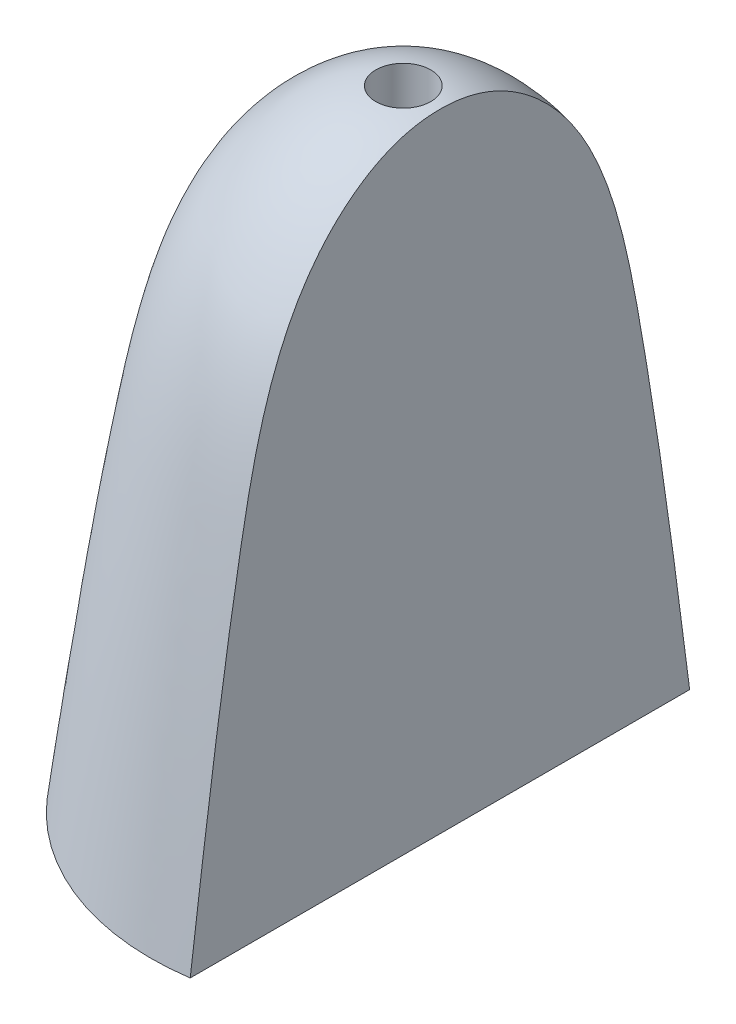
ISO-10303-21;
HEADER;
FILE_DESCRIPTION(('STEP AP214'),'2;1');
FILE_NAME('part.step','',(''),(''),'','','');
FILE_SCHEMA(('AUTOMOTIVE_DESIGN { 1 0 10303 214 1 1 1 1 }'));
ENDSEC;
DATA;
#1=APPLICATION_CONTEXT('core data for automotive mechanical design processes');
#2=APPLICATION_PROTOCOL_DEFINITION('international standard','automotive_design',2000,#1);
#3=PRODUCT_CONTEXT('',#1,'mechanical');
#4=PRODUCT('Part','Part','',(#3));
#5=PRODUCT_RELATED_PRODUCT_CATEGORY('part','',(#4));
#6=PRODUCT_DEFINITION_FORMATION('','',#4);
#7=PRODUCT_DEFINITION_CONTEXT('part definition',#1,'design');
#8=PRODUCT_DEFINITION('design','',#6,#7);
#9=PRODUCT_DEFINITION_SHAPE('','',#8);
#10=(LENGTH_UNIT() NAMED_UNIT(*) SI_UNIT(.MILLI.,.METRE.));
#11=(NAMED_UNIT(*) PLANE_ANGLE_UNIT() SI_UNIT($,.RADIAN.));
#12=(NAMED_UNIT(*) SI_UNIT($,.STERADIAN.) SOLID_ANGLE_UNIT());
#13=UNCERTAINTY_MEASURE_WITH_UNIT(LENGTH_MEASURE(1.E-05),#10,'distance_accuracy_value','');
#14=(GEOMETRIC_REPRESENTATION_CONTEXT(3) GLOBAL_UNCERTAINTY_ASSIGNED_CONTEXT((#13)) GLOBAL_UNIT_ASSIGNED_CONTEXT((#10,
#11,#12)) REPRESENTATION_CONTEXT('',''));
#15=CARTESIAN_POINT('',(0.,0.,0.));
#16=DIRECTION('',(0.,0.,1.));
#17=DIRECTION('',(1.,0.,0.));
#18=AXIS2_PLACEMENT_3D('',#15,#16,#17);
#19=CARTESIAN_POINT('',(6.88,0.,0.));
#20=CARTESIAN_POINT('',(6.47690165518344,3.17769283241905,0.));
#21=CARTESIAN_POINT('',(5.80886829189499,8.35775424687315,0.));
#22=CARTESIAN_POINT('',(4.37828927648046,15.4645962006851,0.));
#23=CARTESIAN_POINT('',(1.11106057892877,17.2802335156458,0.));
#24=CARTESIAN_POINT('',(0.,17.2,0.));
#25=B_SPLINE_CURVE_WITH_KNOTS('',3,(#19,#20,#21,#22,#23,#24),.UNSPECIFIED.,.F.,.F.,(4,1,1,4),
(0.,0.473754928065121,0.83849243058151,1.),.UNSPECIFIED.);
#26=CARTESIAN_POINT('',(0.,18.0579057061154,0.));
#27=DIRECTION('',(0.,1.,0.));
#28=AXIS1_PLACEMENT('',#26,#27);
#29=SURFACE_OF_REVOLUTION('',#25,#28);
#30=CARTESIAN_POINT('',(0.,17.1593653620972,0.));
#31=DIRECTION('',(0.,1.,0.));
#32=DIRECTION('',(0.,0.,1.));
#33=AXIS2_PLACEMENT_3D('',#30,#31,#32);
#34=CIRCLE('',#33,0.750000000000002);
#35=CARTESIAN_POINT('',(0.,17.1593653620972,0.750000000000002));
#36=VERTEX_POINT('',#35);
#37=EDGE_CURVE('E185',#36,#36,#34,.F.);
#38=ORIENTED_EDGE('',*,*,#37,.T.);
#39=EDGE_LOOP('',(#38));
#40=FACE_BOUND('',#39,.T.);
#41=CARTESIAN_POINT('',(1.,0.,-6.8069376374402));
#42=CARTESIAN_POINT('',(1.,0.325630724910655,-6.76518373550329));
#43=CARTESIAN_POINT('',(1.,0.651253473278133,-6.7233642438564));
#44=CARTESIAN_POINT('',(1.,1.30351985313046,-6.63913779643726));
#45=CARTESIAN_POINT('',(1.,1.63016329230628,-6.5967293532776));
#46=CARTESIAN_POINT('',(1.,2.28420434834058,-6.51102917643607));
#47=CARTESIAN_POINT('',(1.,2.61160170115588,-6.46773542117755));
#48=CARTESIAN_POINT('',(1.,3.26688126965538,-6.37995188866716));
#49=CARTESIAN_POINT('',(1.,3.59476319775362,-6.33545995928494));
#50=CARTESIAN_POINT('',(1.,4.25074316902371,-6.2449711752896));
#51=CARTESIAN_POINT('',(1.,4.5788409596492,-6.19897248531578));
#52=CARTESIAN_POINT('',(1.,5.2349861630474,-6.10517878849851));
#53=CARTESIAN_POINT('',(1.,5.56303342070914,-6.05738269418856));
#54=CARTESIAN_POINT('',(1.,6.23911470271178,-5.95671223634639));
#55=CARTESIAN_POINT('',(1.,6.58712922706167,-5.90370665303548));
#56=CARTESIAN_POINT('',(1.,7.28260491822555,-5.79510441209983));
#57=CARTESIAN_POINT('',(1.,7.63006625625954,-5.73950885409394));
#58=CARTESIAN_POINT('',(1.,8.15076053294847,-5.65400676545338));
#59=CARTESIAN_POINT('',(1.,8.3241691708583,-5.6251672410478));
#60=CARTESIAN_POINT('',(1.,8.67086436631517,-5.56675582456074));
#61=CARTESIAN_POINT('',(1.,8.84415092308082,-5.53718392783465));
#62=CARTESIAN_POINT('',(1.,9.10387448944329,-5.49228070846698));
#63=CARTESIAN_POINT('',(1.,9.1903603823503,-5.47723169501576));
#64=CARTESIAN_POINT('',(1.,9.36329907182524,-5.44694479601924));
#65=CARTESIAN_POINT('',(1.,9.4497518683796,-5.43170691039652));
#66=CARTESIAN_POINT('',(1.,9.70903044976889,-5.38554687526954));
#67=CARTESIAN_POINT('',(1.,9.8817775984942,-5.3541781471419));
#68=CARTESIAN_POINT('',(1.,10.2266383602988,-5.28943838767826));
#69=CARTESIAN_POINT('',(1.,10.3987525302671,-5.25607034908394));
#70=CARTESIAN_POINT('',(1.,10.7424036282819,-5.18643548096292));
#71=CARTESIAN_POINT('',(1.,10.9139405407412,-5.1501685738042));
#72=CARTESIAN_POINT('',(1.,11.2561398475446,-5.07386867623961));
#73=CARTESIAN_POINT('',(1.,11.4268024321778,-5.03383654551293));
#74=CARTESIAN_POINT('',(1.,11.7669547684463,-4.94908748588783));
#75=CARTESIAN_POINT('',(1.,11.9364446381214,-4.9043710360243));
#76=CARTESIAN_POINT('',(1.,12.2186448331177,-4.82483876658157));
#77=CARTESIAN_POINT('',(1.,12.3317910862566,-4.79156964529218));
#78=CARTESIAN_POINT('',(1.,12.5572074840467,-4.72216050903644));
#79=CARTESIAN_POINT('',(1.,12.6694775996119,-4.6860203992));
#80=CARTESIAN_POINT('',(1.,12.892949141258,-4.61054984847056));
#81=CARTESIAN_POINT('',(1.,13.0041505237877,-4.57121927817673));
#82=CARTESIAN_POINT('',(1.,13.2248506998165,-4.48918974666945));
#83=CARTESIAN_POINT('',(1.,13.3343541936387,-4.44650347075803));
#84=CARTESIAN_POINT('',(1.,13.5518114820349,-4.35730537690135));
#85=CARTESIAN_POINT('',(1.,13.6597651214702,-4.31079317907875));
#86=CARTESIAN_POINT('',(1.,13.873798179127,-4.21362034556357));
#87=CARTESIAN_POINT('',(1.,13.9798774630547,-4.1629594140761));
#88=CARTESIAN_POINT('',(1.,14.2442558566948,-4.02972818894831));
#89=CARTESIAN_POINT('',(1.,14.4011025571077,-3.94423618672721));
#90=CARTESIAN_POINT('',(1.,14.7081254864984,-3.76196383121557));
#91=CARTESIAN_POINT('',(0.999999999999999,14.858301920545,-3.66518382529215));
#92=CARTESIAN_POINT('',(1.,15.1502452259197,-3.45961208819087));
#93=CARTESIAN_POINT('',(1.00000000000001,15.2920120325885,-3.35082026467591));
#94=CARTESIAN_POINT('',(0.999999999999993,15.5651897070575,-3.12092349296525));
#95=CARTESIAN_POINT('',(0.999999999999972,15.6966036483847,-2.99982222379811));
#96=CARTESIAN_POINT('',(0.999999999999979,15.9090810342319,-2.78426965377604));
#97=CARTESIAN_POINT('',(0.999999999999995,15.9933027534781,-2.69291406131553));
#98=CARTESIAN_POINT('',(1.00000000000001,16.1551705918999,-2.50453400701932));
#99=CARTESIAN_POINT('',(1.,16.232817122197,-2.40750990025634));
#100=CARTESIAN_POINT('',(0.999999999999999,16.3803975765514,-2.20798317453374));
#101=CARTESIAN_POINT('',(1.,16.4503436940124,-2.10548960991976));
#102=CARTESIAN_POINT('',(1.,16.5814804128002,-1.89503426851931));
#103=CARTESIAN_POINT('',(1.,16.6426726862794,-1.78707354141495));
#104=CARTESIAN_POINT('',(1.,16.7458499010108,-1.58399007412601));
#105=CARTESIAN_POINT('',(1.,16.7893401615443,-1.48963244751748));
#106=CARTESIAN_POINT('',(1.,16.8684663428114,-1.2976860907947));
#107=CARTESIAN_POINT('',(1.,16.904104080725,-1.20009811425233));
#108=CARTESIAN_POINT('',(1.,16.9668758424214,-1.00217582353099));
#109=CARTESIAN_POINT('',(1.,16.9940067437563,-0.901840515598335));
#110=CARTESIAN_POINT('',(1.,17.0393553411734,-0.699169088723154));
#111=CARTESIAN_POINT('',(1.,17.0575725533354,-0.596832861465198));
#112=CARTESIAN_POINT('',(1.,17.085128351924,-0.390940077489392));
#113=CARTESIAN_POINT('',(1.,17.0944633649685,-0.287383046579562));
#114=CARTESIAN_POINT('',(1.,17.1045564194792,-0.0798435310542998));
#115=CARTESIAN_POINT('',(1.,17.1053131164444,0.0241390176988233));
#116=CARTESIAN_POINT('',(1.,17.0982910700647,0.231757145355891));
#117=CARTESIAN_POINT('',(1.,17.0905175908188,0.335392898704497));
#118=CARTESIAN_POINT('',(1.,17.0661386231189,0.541606437185932));
#119=CARTESIAN_POINT('',(1.,17.0495352248645,0.644184466845228));
#120=CARTESIAN_POINT('',(1.,17.0073986232804,0.847449796567969));
#121=CARTESIAN_POINT('',(1.,16.9818689106768,0.948137819542963));
#122=CARTESIAN_POINT('',(1.,16.9222004958238,1.14692926615582));
#123=CARTESIAN_POINT('',(1.,16.8880610864179,1.24503247675905));
#124=CARTESIAN_POINT('',(1.,16.811766122454,1.43817911998058));
#125=CARTESIAN_POINT('',(1.,16.7696020313018,1.53321916697461));
#126=CARTESIAN_POINT('',(1.,16.6780378957834,1.71978317009742));
#127=CARTESIAN_POINT('',(1.,16.6286340991481,1.81130527167035));
#128=CARTESIAN_POINT('',(1.,16.5048092158707,2.02220966681855));
#129=CARTESIAN_POINT('',(1.,16.4277118126913,2.14002724153519));
#130=CARTESIAN_POINT('',(1.,16.2635424264656,2.36844283285249));
#131=CARTESIAN_POINT('',(1.,16.1764668513271,2.47903822686907));
#132=CARTESIAN_POINT('',(1.,15.9024935010686,2.79990233734617));
#133=CARTESIAN_POINT('',(1.,15.7027358619353,2.99943418646462));
#134=CARTESIAN_POINT('',(1.,15.3928056084428,3.26757693012212));
#135=CARTESIAN_POINT('',(1.,15.2928353835745,3.34848066450858));
#136=CARTESIAN_POINT('',(1.,15.0880346673323,3.50403566921137));
#137=CARTESIAN_POINT('',(1.,14.9832020688562,3.57868418876094));
#138=CARTESIAN_POINT('',(1.,14.7694244196884,3.72184897244149));
#139=CARTESIAN_POINT('',(1.,14.6604785067774,3.79036394061711));
#140=CARTESIAN_POINT('',(1.,14.4388365611266,3.92171580713985));
#141=CARTESIAN_POINT('',(1.,14.3261314030833,3.98453726772779));
#142=CARTESIAN_POINT('',(1.,14.0978636756859,4.10463869346656));
#143=CARTESIAN_POINT('',(1.,13.982302057936,4.16192047368718));
#144=CARTESIAN_POINT('',(1.,13.7488770930997,4.27133055660323));
#145=CARTESIAN_POINT('',(1.,13.6310154056141,4.32346242170285));
#146=CARTESIAN_POINT('',(1.,13.2187402211602,4.49621877597788));
#147=CARTESIAN_POINT('',(1.,12.9193164074057,4.60495871881363));
#148=CARTESIAN_POINT('',(1.,12.313160346503,4.80051813553175));
#149=CARTESIAN_POINT('',(1.,12.0064175984661,4.88730374723454));
#150=CARTESIAN_POINT('',(1.,11.3877766589818,5.04509578818482));
#151=CARTESIAN_POINT('',(1.,11.075863653563,5.11604299756951));
#152=CARTESIAN_POINT('',(1.,10.6059487597747,5.21451770021536));
#153=CARTESIAN_POINT('',(1.,10.44875454059,5.24605568024259));
#154=CARTESIAN_POINT('',(1.,10.1339696996392,5.3070980812102));
#155=CARTESIAN_POINT('',(1.,9.97637907758946,5.33660250069485));
#156=CARTESIAN_POINT('',(1.,9.66095238364621,5.39421614948321));
#157=CARTESIAN_POINT('',(1.,9.50311632095862,5.42232542987273));
#158=CARTESIAN_POINT('',(1.,9.1873236436048,5.47785375048928));
#159=CARTESIAN_POINT('',(1.,9.02936702926569,5.50527279258253));
#160=CARTESIAN_POINT('',(1.,8.71157512891945,5.55980887427358));
#161=CARTESIAN_POINT('',(1.,8.55173866698994,5.58691906383199));
#162=CARTESIAN_POINT('',(1.,8.23196174349966,5.64051646427551));
#163=CARTESIAN_POINT('',(1.,8.0720212821457,5.66700367639563));
#164=CARTESIAN_POINT('',(1.,7.59287945564179,5.74542981041913));
#165=CARTESIAN_POINT('',(1.,7.27353140934863,5.79647483299838));
#166=CARTESIAN_POINT('',(1.,6.63500901646421,5.89627368474961));
#167=CARTESIAN_POINT('',(1.,6.31583522837623,5.94503109613245));
#168=CARTESIAN_POINT('',(1.,5.67740543995403,6.04053663011164));
#169=CARTESIAN_POINT('',(1.,5.35814963671147,6.08728607220366));
#170=CARTESIAN_POINT('',(1.,4.71930413137382,6.17908284350568));
#171=CARTESIAN_POINT('',(1.,4.39971436154091,6.22412970045101));
#172=CARTESIAN_POINT('',(1.,3.90926493029905,6.29214406194618));
#173=CARTESIAN_POINT('',(1.,3.73847568222654,6.31562131142407));
#174=CARTESIAN_POINT('',(1.,3.3967632415407,6.36222687449056));
#175=CARTESIAN_POINT('',(1.,3.22584002451562,6.38535500914882));
#176=CARTESIAN_POINT('',(1.,2.88389480560939,6.43130515751945));
#177=CARTESIAN_POINT('',(1.,2.71287278976421,6.45412706721072));
#178=CARTESIAN_POINT('',(1.,2.37076516339941,6.49950840024231));
#179=CARTESIAN_POINT('',(1.,2.19967954703954,6.52206777952893));
#180=CARTESIAN_POINT('',(1.,1.85950073294312,6.56670266264592));
#181=CARTESIAN_POINT('',(1.,1.69040787189081,6.58878073443648));
#182=CARTESIAN_POINT('',(1.,1.35222856661231,6.63276507481999));
#183=CARTESIAN_POINT('',(1.,1.18314212603904,6.65467137151688));
#184=CARTESIAN_POINT('',(1.,0.845009687406819,6.69835319024418));
#185=CARTESIAN_POINT('',(1.,0.675963694661787,6.72012875344397));
#186=CARTESIAN_POINT('',(1.,0.337945932863498,6.76358837022412));
#187=CARTESIAN_POINT('',(1.,0.168974168998467,6.78527246414375));
#188=CARTESIAN_POINT('',(1.,0.,6.8069376374402));
#189=B_SPLINE_CURVE_WITH_KNOTS('',3,(#41,#42,#43,#44,#45,#46,#47,#48,#49,#50,#51,#52,#53,#54,
#55,#56,#57,#58,#59,#60,#61,#62,#63,#64,#65,#66,#67,#68,#69,#70,#71,#72,#73,#74,#75,#76,#77,#78,
#79,#80,#81,#82,#83,#84,#85,#86,#87,#88,#89,#90,#91,#92,#93,#94,#95,#96,#97,#98,#99,#100,#101,
#102,#103,#104,#105,#106,#107,#108,#109,#110,#111,#112,#113,#114,#115,#116,#117,#118,#119,#120,
#121,#122,#123,#124,#125,#126,#127,#128,#129,#130,#131,#132,#133,#134,#135,#136,#137,#138,#139,
#140,#141,#142,#143,#144,#145,#146,#147,#148,#149,#150,#151,#152,#153,#154,#155,#156,#157,#158,
#159,#160,#161,#162,#163,#164,#165,#166,#167,#168,#169,#170,#171,#172,#173,#174,#175,#176,#177,
#178,#179,#180,#181,#182,#183,#184,#185,#186,#187,#188),.UNSPECIFIED.,.F.,.F.,(4,2,2,2,2,2,2,2,
2,2,2,2,2,2,2,2,2,2,2,2,2,2,2,2,2,2,2,2,2,2,2,2,2,2,2,2,2,2,2,2,2,2,2,2,2,2,2,2,2,2,2,2,2,2,2,2,
2,2,2,2,2,2,2,2,2,2,2,2,2,2,2,2,2,4),(0.,0.984890943744065,1.97304523803312,2.96378620094933,
3.95644417958091,4.95035988641057,5.94488692536696,7.00096224815413,8.05659321093775,
8.58396321759192,9.11133656961654,9.37469266193548,9.63804886222473,10.1647576953517,
10.690696901358,11.2166501967967,11.742483696285,12.2682634745952,12.6220393819107,
12.975826984407,13.3296289432399,13.682152432191,14.0347109656917,14.3872946577023,
14.922752745355,15.4581943596352,15.9936400902422,16.5289262555884,16.9014215957282,
17.273893627923,17.6457671093511,18.0175694606791,18.3289464358566,18.640251278337,
18.9516702523532,19.2631061312907,19.5746672505479,19.8862772008878,20.1976949601657,
20.5090390340906,20.8202614896727,21.1315095158048,21.443090514829,21.7548335781879,
22.1765785781657,22.598475884064,23.4416265896366,23.8272861979642,24.2131145218962,
24.5990241758597,24.9859507228708,25.3727500612588,25.759279933286,26.7136298536801,
27.6694429019495,28.628772014043,29.1097456406348,29.5907196115311,30.0716759575908,
30.5526310031282,31.0389875177998,31.5253430682212,32.495539379721,33.4641619466859,
34.4321379483444,35.4003805065352,35.917566166168,36.4350084643139,36.9526222952441,
37.4703217665807,37.9819059960161,38.4934047020968,39.0047328563696,39.5158051387089),.UNSPECIFIED.);
#190=CARTESIAN_POINT('',(1.,0.,-6.8069376374402));
#191=VERTEX_POINT('',#190);
#192=CARTESIAN_POINT('',(1.,0.,6.8069376374402));
#193=VERTEX_POINT('',#192);
#194=EDGE_CURVE('E54',#191,#193,#189,.T.);
#195=ORIENTED_EDGE('',*,*,#194,.F.);
#196=CARTESIAN_POINT('',(0.,0.,0.));
#197=DIRECTION('',(0.,1.,0.));
#198=DIRECTION('',(0.,0.,1.));
#199=AXIS2_PLACEMENT_3D('',#196,#197,#198);
#200=CIRCLE('',#199,6.88);
#201=EDGE_CURVE('E105',#191,#193,#200,.T.);
#202=ORIENTED_EDGE('',*,*,#201,.T.);
#203=EDGE_LOOP('',(#195,#202));
#204=FACE_BOUND('',#203,.T.);
#205=ADVANCED_FACE('F33',(#40,#204),#29,.T.);
#206=CARTESIAN_POINT('',(4.88,0.,0.));
#207=DIRECTION('',(0.,1.,0.));
#208=DIRECTION('',(0.,0.,1.));
#209=AXIS2_PLACEMENT_3D('',#206,#207,#208);
#210=PLANE('',#209);
#211=DIRECTION('',(0.,0.,1.));
#212=VECTOR('',#211,1.);
#213=CARTESIAN_POINT('',(0.,0.,0.));
#214=LINE('',#213,#212);
#215=CARTESIAN_POINT('',(0.,0.,-4.88));
#216=VERTEX_POINT('',#215);
#217=CARTESIAN_POINT('',(0.,0.,4.88));
#218=VERTEX_POINT('',#217);
#219=EDGE_CURVE('E176',#216,#218,#214,.T.);
#220=ORIENTED_EDGE('',*,*,#219,.F.);
#221=CARTESIAN_POINT('',(0.,0.,0.));
#222=DIRECTION('',(0.,1.,0.));
#223=DIRECTION('',(0.,0.,1.));
#224=AXIS2_PLACEMENT_3D('',#221,#222,#223);
#225=CIRCLE('',#224,4.88);
#226=EDGE_CURVE('E102',#216,#218,#225,.T.);
#227=ORIENTED_EDGE('',*,*,#226,.T.);
#228=EDGE_LOOP('',(#220,#227));
#229=FACE_BOUND('',#228,.T.);
#230=DIRECTION('',(0.,0.,-1.));
#231=VECTOR('',#230,1.);
#232=CARTESIAN_POINT('',(1.,0.,0.));
#233=LINE('',#232,#231);
#234=EDGE_CURVE('E88',#193,#191,#233,.T.);
#235=ORIENTED_EDGE('',*,*,#234,.F.);
#236=ORIENTED_EDGE('',*,*,#201,.F.);
#237=EDGE_LOOP('',(#235,#236));
#238=FACE_BOUND('',#237,.T.);
#239=ADVANCED_FACE('F136',(#229,#238),#210,.F.);
#240=CARTESIAN_POINT('',(0.,15.4,0.));
#241=CARTESIAN_POINT('',(1.56302961911326,15.2977602080588,0.));
#242=CARTESIAN_POINT('',(2.28424319668184,13.6331974498387,0.));
#243=B_SPLINE_CURVE_WITH_KNOTS('',2,(#240,#241,#242),.UNSPECIFIED.,.F.,.F.,(3,3),(0.,1.),.UNSPECIFIED.);
#244=CARTESIAN_POINT('',(0.,18.0579057061154,0.));
#245=DIRECTION('',(0.,1.,0.));
#246=AXIS1_PLACEMENT('',#244,#245);
#247=SURFACE_OF_REVOLUTION('',#243,#246);
#248=CARTESIAN_POINT('',(0.,15.4,0.));
#249=CARTESIAN_POINT('',(0.,15.2977602080588,-1.56302961911326));
#250=CARTESIAN_POINT('',(0.,13.6331974498387,-2.28424319668184));
#251=B_SPLINE_CURVE_WITH_KNOTS('',2,(#248,#249,#250),.UNSPECIFIED.,.F.,.F.,(3,3),(0.,1.),.UNSPECIFIED.);
#252=CARTESIAN_POINT('',(0.,15.2434332079806,-0.749999999999999));
#253=VERTEX_POINT('',#252);
#254=CARTESIAN_POINT('',(0.,13.6331974498387,-2.28424319668184));
#255=VERTEX_POINT('',#254);
#256=EDGE_CURVE('E169',#253,#255,#251,.T.);
#257=ORIENTED_EDGE('',*,*,#256,.F.);
#258=CARTESIAN_POINT('',(0.,15.2434332079806,0.));
#259=DIRECTION('',(0.,1.,0.));
#260=DIRECTION('',(0.,0.,1.));
#261=AXIS2_PLACEMENT_3D('',#258,#259,#260);
#262=CIRCLE('',#261,0.75);
#263=CARTESIAN_POINT('',(0.,15.2434332116117,0.75));
#264=VERTEX_POINT('',#263);
#265=EDGE_CURVE('E94',#253,#264,#262,.T.);
#266=ORIENTED_EDGE('',*,*,#265,.T.);
#267=CARTESIAN_POINT('',(0.,15.4,0.));
#268=CARTESIAN_POINT('',(0.,15.2977602080588,1.56302961911326));
#269=CARTESIAN_POINT('',(0.,13.6331974498387,2.28424319668184));
#270=B_SPLINE_CURVE_WITH_KNOTS('',2,(#267,#268,#269),.UNSPECIFIED.,.F.,.F.,(3,3),(0.,1.),.UNSPECIFIED.);
#271=CARTESIAN_POINT('',(0.,13.6331974498387,2.28424319668184));
#272=VERTEX_POINT('',#271);
#273=EDGE_CURVE('E99',#272,#264,#270,.F.);
#274=ORIENTED_EDGE('',*,*,#273,.F.);
#275=CARTESIAN_POINT('',(0.,13.6331974498387,0.));
#276=DIRECTION('',(0.,1.,0.));
#277=DIRECTION('',(0.,0.,1.));
#278=AXIS2_PLACEMENT_3D('',#275,#276,#277);
#279=CIRCLE('',#278,2.28424319668184);
#280=EDGE_CURVE('E108',#255,#272,#279,.T.);
#281=ORIENTED_EDGE('',*,*,#280,.F.);
#282=EDGE_LOOP('',(#257,#266,#274,#281));
#283=FACE_BOUND('',#282,.T.);
#284=ADVANCED_FACE('F133',(#283),#247,.T.);
#285=CARTESIAN_POINT('',(0.,0.803124562942561,0.));
#286=DIRECTION('',(0.,1.,0.));
#287=DIRECTION('',(0.,0.,1.));
#288=AXIS2_PLACEMENT_3D('',#285,#286,#287);
#289=DEGENERATE_TOROIDAL_SURFACE('',#288,7.58838532482872,12.4942243325468,.F.);
#290=CARTESIAN_POINT('',(0.,0.803124562942561,7.58838532482872));
#291=DIRECTION('',(1.,0.,0.));
#292=DIRECTION('',(0.,0.,-1.));
#293=AXIS2_PLACEMENT_3D('',#290,#291,#292);
#294=CIRCLE('',#293,12.4942243325468);
#295=CARTESIAN_POINT('',(0.,1.60624912588512,-4.88));
#296=VERTEX_POINT('',#295);
#297=EDGE_CURVE('E160',#296,#216,#294,.F.);
#298=ORIENTED_EDGE('',*,*,#297,.F.);
#299=CARTESIAN_POINT('',(0.,1.60624912588512,0.));
#300=DIRECTION('',(0.,1.,0.));
#301=DIRECTION('',(0.,0.,1.));
#302=AXIS2_PLACEMENT_3D('',#299,#300,#301);
#303=CIRCLE('',#302,4.88);
#304=CARTESIAN_POINT('',(0.,1.60624912588512,4.88));
#305=VERTEX_POINT('',#304);
#306=EDGE_CURVE('E111',#296,#305,#303,.T.);
#307=ORIENTED_EDGE('',*,*,#306,.T.);
#308=CARTESIAN_POINT('',(0.,0.803124562942561,-7.58838532482872));
#309=DIRECTION('',(1.,0.,0.));
#310=DIRECTION('',(0.,0.,-1.));
#311=AXIS2_PLACEMENT_3D('',#308,#309,#310);
#312=CIRCLE('',#311,12.4942243325468);
#313=EDGE_CURVE('E114',#218,#305,#312,.F.);
#314=ORIENTED_EDGE('',*,*,#313,.F.);
#315=ORIENTED_EDGE('',*,*,#226,.F.);
#316=EDGE_LOOP('',(#298,#307,#314,#315));
#317=FACE_BOUND('',#316,.T.);
#318=ADVANCED_FACE('F35',(#317),#289,.T.);
#319=CARTESIAN_POINT('',(2.28424319668184,13.6331974498387,0.));
#320=CARTESIAN_POINT('',(4.26625949687921,7.77835124400765,0.));
#321=CARTESIAN_POINT('',(4.88,1.60624912588512,0.));
#322=B_SPLINE_CURVE_WITH_KNOTS('',2,(#319,#320,#321),.UNSPECIFIED.,.F.,.F.,(3,3),(0.,1.),.UNSPECIFIED.);
#323=CARTESIAN_POINT('',(0.,18.0579057061154,0.));
#324=DIRECTION('',(0.,1.,0.));
#325=AXIS1_PLACEMENT('',#323,#324);
#326=SURFACE_OF_REVOLUTION('',#322,#325);
#327=CARTESIAN_POINT('',(0.,13.6331974498387,-2.28424319668184));
#328=CARTESIAN_POINT('',(0.,7.77835124400765,-4.26625949687921));
#329=CARTESIAN_POINT('',(0.,1.60624912588512,-4.88));
#330=B_SPLINE_CURVE_WITH_KNOTS('',2,(#327,#328,#329),.UNSPECIFIED.,.F.,.F.,(3,3),(0.,1.),.UNSPECIFIED.);
#331=EDGE_CURVE('E165',#255,#296,#330,.T.);
#332=ORIENTED_EDGE('',*,*,#331,.F.);
#333=ORIENTED_EDGE('',*,*,#280,.T.);
#334=CARTESIAN_POINT('',(0.,13.6331974498387,2.28424319668184));
#335=CARTESIAN_POINT('',(0.,7.77835124400765,4.26625949687921));
#336=CARTESIAN_POINT('',(0.,1.60624912588512,4.88));
#337=B_SPLINE_CURVE_WITH_KNOTS('',2,(#334,#335,#336),.UNSPECIFIED.,.F.,.F.,(3,3),(0.,1.),.UNSPECIFIED.);
#338=EDGE_CURVE('E150',#305,#272,#337,.F.);
#339=ORIENTED_EDGE('',*,*,#338,.F.);
#340=ORIENTED_EDGE('',*,*,#306,.F.);
#341=EDGE_LOOP('',(#332,#333,#339,#340));
#342=FACE_BOUND('',#341,.T.);
#343=ADVANCED_FACE('F127',(#342),#326,.T.);
#344=CARTESIAN_POINT('',(0.,9.80955029560996,5.45943951485915));
#345=DIRECTION('',(1.,0.,0.));
#346=DIRECTION('',(0.,0.,-1.));
#347=AXIS2_PLACEMENT_3D('',#344,#345,#346);
#348=PLANE('',#347);
#349=DIRECTION('',(0.,0.,1.));
#350=VECTOR('',#349,1.);
#351=CARTESIAN_POINT('',(0.,13.,5.45943951485915));
#352=LINE('',#351,#350);
#353=CARTESIAN_POINT('',(0.,13.,-0.750000000000001));
#354=VERTEX_POINT('',#353);
#355=CARTESIAN_POINT('',(0.,13.,0.75));
#356=VERTEX_POINT('',#355);
#357=EDGE_CURVE('E84',#354,#356,#352,.T.);
#358=ORIENTED_EDGE('',*,*,#357,.F.);
#359=DIRECTION('',(0.,1.,0.));
#360=VECTOR('',#359,1.);
#361=CARTESIAN_POINT('',(0.,13.,-0.75));
#362=LINE('',#361,#360);
#363=EDGE_CURVE('E11',#354,#253,#362,.T.);
#364=ORIENTED_EDGE('',*,*,#363,.T.);
#365=ORIENTED_EDGE('',*,*,#256,.T.);
#366=ORIENTED_EDGE('',*,*,#331,.T.);
#367=ORIENTED_EDGE('',*,*,#297,.T.);
#368=ORIENTED_EDGE('',*,*,#219,.T.);
#369=ORIENTED_EDGE('',*,*,#313,.T.);
#370=ORIENTED_EDGE('',*,*,#338,.T.);
#371=ORIENTED_EDGE('',*,*,#273,.T.);
#372=DIRECTION('',(0.,1.,0.));
#373=VECTOR('',#372,1.);
#374=CARTESIAN_POINT('',(0.,13.,0.75));
#375=LINE('',#374,#373);
#376=EDGE_CURVE('E41',#264,#356,#375,.F.);
#377=ORIENTED_EDGE('',*,*,#376,.T.);
#378=EDGE_LOOP('',(#358,#364,#365,#366,#367,#368,#369,#370,#371,#377));
#379=FACE_BOUND('',#378,.T.);
#380=ADVANCED_FACE('F97',(#379),#348,.F.);
#381=CARTESIAN_POINT('',(1.,0.,0.));
#382=DIRECTION('',(1.,0.,0.));
#383=DIRECTION('',(0.,0.,-1.));
#384=AXIS2_PLACEMENT_3D('',#381,#382,#383);
#385=PLANE('',#384);
#386=ORIENTED_EDGE('',*,*,#194,.T.);
#387=ORIENTED_EDGE('',*,*,#234,.T.);
#388=EDGE_LOOP('',(#386,#387));
#389=FACE_BOUND('',#388,.T.);
#390=ADVANCED_FACE('F187',(#389),#385,.T.);
#391=CARTESIAN_POINT('',(0.,13.,0.));
#392=DIRECTION('',(0.,1.,0.));
#393=DIRECTION('',(0.,0.,1.));
#394=AXIS2_PLACEMENT_3D('',#391,#392,#393);
#395=CYLINDRICAL_SURFACE('',#394,0.75);
#396=CARTESIAN_POINT('',(0.,13.,0.));
#397=DIRECTION('',(0.,1.,0.));
#398=DIRECTION('',(0.,0.,1.));
#399=AXIS2_PLACEMENT_3D('',#396,#397,#398);
#400=CIRCLE('',#399,0.75);
#401=EDGE_CURVE('E47',#356,#354,#400,.T.);
#402=ORIENTED_EDGE('',*,*,#401,.F.);
#403=ORIENTED_EDGE('',*,*,#376,.F.);
#404=ORIENTED_EDGE('',*,*,#265,.F.);
#405=ORIENTED_EDGE('',*,*,#363,.F.);
#406=EDGE_LOOP('',(#402,#403,#404,#405));
#407=FACE_BOUND('',#406,.T.);
#408=ORIENTED_EDGE('',*,*,#37,.F.);
#409=EDGE_LOOP('',(#408));
#410=FACE_BOUND('',#409,.T.);
#411=ADVANCED_FACE('F91',(#407,#410),#395,.F.);
#412=CARTESIAN_POINT('',(0.,13.,0.));
#413=DIRECTION('',(0.,1.,0.));
#414=DIRECTION('',(0.,0.,1.));
#415=AXIS2_PLACEMENT_3D('',#412,#413,#414);
#416=PLANE('',#415);
#417=ORIENTED_EDGE('',*,*,#357,.T.);
#418=ORIENTED_EDGE('',*,*,#401,.T.);
#419=EDGE_LOOP('',(#417,#418));
#420=FACE_BOUND('',#419,.T.);
#421=ADVANCED_FACE('F85',(#420),#416,.T.);
#422=CLOSED_SHELL('',(#205,#239,#284,#318,#343,#380,#390,#411,#421));
#423=MANIFOLD_SOLID_BREP('B2',#422);
#424=ADVANCED_BREP_SHAPE_REPRESENTATION('',(#18,#423),#14);
#425=SHAPE_DEFINITION_REPRESENTATION(#9,#424);
ENDSEC;
END-ISO-10303-21;
